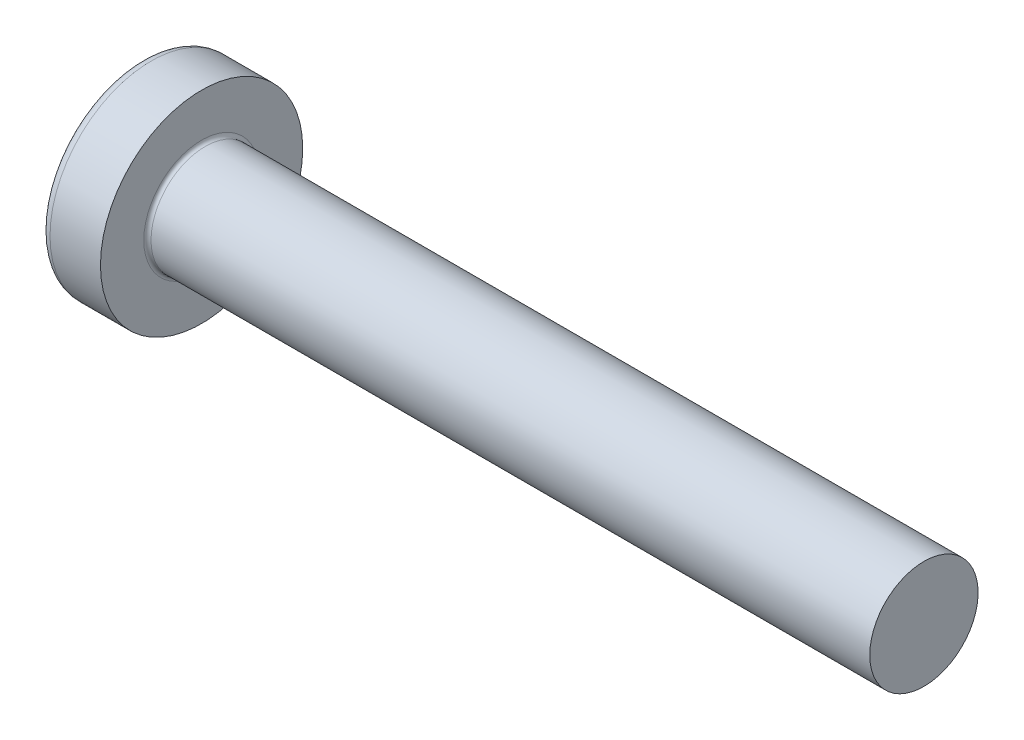
ISO-10303-21;
HEADER;
FILE_DESCRIPTION(('STEP AP214'),'2;1');
FILE_NAME('part.step','',(''),(''),'','','');
FILE_SCHEMA(('AUTOMOTIVE_DESIGN { 1 0 10303 214 1 1 1 1 }'));
ENDSEC;
DATA;
#1=APPLICATION_CONTEXT('core data for automotive mechanical design processes');
#2=APPLICATION_PROTOCOL_DEFINITION('international standard','automotive_design',2000,#1);
#3=PRODUCT_CONTEXT('',#1,'mechanical');
#4=PRODUCT('Part','Part','',(#3));
#5=PRODUCT_RELATED_PRODUCT_CATEGORY('part','',(#4));
#6=PRODUCT_DEFINITION_FORMATION('','',#4);
#7=PRODUCT_DEFINITION_CONTEXT('part definition',#1,'design');
#8=PRODUCT_DEFINITION('design','',#6,#7);
#9=PRODUCT_DEFINITION_SHAPE('','',#8);
#10=(LENGTH_UNIT() NAMED_UNIT(*) SI_UNIT(.MILLI.,.METRE.));
#11=(NAMED_UNIT(*) PLANE_ANGLE_UNIT() SI_UNIT($,.RADIAN.));
#12=(NAMED_UNIT(*) SI_UNIT($,.STERADIAN.) SOLID_ANGLE_UNIT());
#13=UNCERTAINTY_MEASURE_WITH_UNIT(LENGTH_MEASURE(1.E-05),#10,'distance_accuracy_value','');
#14=(GEOMETRIC_REPRESENTATION_CONTEXT(3) GLOBAL_UNCERTAINTY_ASSIGNED_CONTEXT((#13)) GLOBAL_UNIT_ASSIGNED_CONTEXT((#10,
#11,#12)) REPRESENTATION_CONTEXT('',''));
#15=CARTESIAN_POINT('',(0.,0.,0.));
#16=DIRECTION('',(0.,0.,1.));
#17=DIRECTION('',(1.,0.,0.));
#18=AXIS2_PLACEMENT_3D('',#15,#16,#17);
#19=CARTESIAN_POINT('',(5.,0.,0.));
#20=DIRECTION('',(-1.,0.,0.));
#21=DIRECTION('',(0.,1.,0.));
#22=AXIS2_PLACEMENT_3D('',#19,#20,#21);
#23=SPHERICAL_SURFACE('',#22,5.);
#24=CARTESIAN_POINT('',(0.775371598933733,0.,0.));
#25=DIRECTION('',(-1.,0.,0.));
#26=DIRECTION('',(0.,0.,1.));
#27=AXIS2_PLACEMENT_3D('',#24,#25,#26);
#28=CIRCLE('',#27,2.67441860465116);
#29=CARTESIAN_POINT('',(0.775371598933733,0.,2.67441860465116));
#30=VERTEX_POINT('',#29);
#31=EDGE_CURVE('E237',#30,#30,#28,.T.);
#32=ORIENTED_EDGE('',*,*,#31,.T.);
#33=EDGE_LOOP('',(#32));
#34=FACE_BOUND('',#33,.T.);
#35=CARTESIAN_POINT('',(0.0457951200896417,0.,0.));
#36=DIRECTION('',(1.,0.,0.));
#37=DIRECTION('',(0.,0.,-1.));
#38=AXIS2_PLACEMENT_3D('',#35,#36,#37);
#39=CIRCLE('',#38,0.675169614150692);
#40=CARTESIAN_POINT('',(0.0457951200896426,-0.369999999999998,-0.564760133040918));
#41=VERTEX_POINT('',#40);
#42=CARTESIAN_POINT('',(0.0457951200896417,-0.564760133040917,-0.37));
#43=VERTEX_POINT('',#42);
#44=EDGE_CURVE('E373',#41,#43,#39,.F.);
#45=ORIENTED_EDGE('',*,*,#44,.F.);
#46=CARTESIAN_POINT('',(5.,-0.37,0.));
#47=DIRECTION('',(0.,1.,0.));
#48=DIRECTION('',(0.,0.,1.));
#49=AXIS2_PLACEMENT_3D('',#46,#47,#48);
#50=CIRCLE('',#49,4.98629120689917);
#51=CARTESIAN_POINT('',(0.187869731256034,-0.369999999999995,-1.30633161051784));
#52=VERTEX_POINT('',#51);
#53=EDGE_CURVE('E299',#52,#41,#50,.T.);
#54=ORIENTED_EDGE('',*,*,#53,.F.);
#55=CARTESIAN_POINT('',(4.56358245832426,0.,0.875318202045668));
#56=DIRECTION('',(0.446197800778958,0.,-0.89493436774996));
#57=DIRECTION('',(-0.89493436774996,0.,-0.446197800778958));
#58=AXIS2_PLACEMENT_3D('',#55,#56,#57);
#59=CIRCLE('',#58,4.90340267309195);
#60=CARTESIAN_POINT('',(0.187869731256035,0.370000000000005,-1.30633161051784));
#61=VERTEX_POINT('',#60);
#62=EDGE_CURVE('E271',#52,#61,#59,.T.);
#63=ORIENTED_EDGE('',*,*,#62,.T.);
#64=CARTESIAN_POINT('',(5.,0.37,0.));
#65=DIRECTION('',(0.,-1.,0.));
#66=DIRECTION('',(0.,0.,-1.));
#67=AXIS2_PLACEMENT_3D('',#64,#65,#66);
#68=CIRCLE('',#67,4.98629120689917);
#69=CARTESIAN_POINT('',(0.0457951200896421,0.370000000000002,-0.564760133040916));
#70=VERTEX_POINT('',#69);
#71=EDGE_CURVE('E326',#70,#61,#68,.T.);
#72=ORIENTED_EDGE('',*,*,#71,.F.);
#73=CARTESIAN_POINT('',(0.0457951200896417,0.564760133040914,-0.37));
#74=VERTEX_POINT('',#73);
#75=EDGE_CURVE('E392',#74,#70,#39,.F.);
#76=ORIENTED_EDGE('',*,*,#75,.F.);
#77=CARTESIAN_POINT('',(5.,0.,-0.37));
#78=DIRECTION('',(0.,0.,1.));
#79=DIRECTION('',(1.,0.,0.));
#80=AXIS2_PLACEMENT_3D('',#77,#78,#79);
#81=CIRCLE('',#80,4.98629120689917);
#82=CARTESIAN_POINT('',(0.187869731256034,1.30633161051784,-0.37));
#83=VERTEX_POINT('',#82);
#84=EDGE_CURVE('E265',#83,#74,#81,.T.);
#85=ORIENTED_EDGE('',*,*,#84,.F.);
#86=CARTESIAN_POINT('',(4.56358245832426,-0.875318202045669,0.));
#87=DIRECTION('',(0.446197800778958,0.89493436774996,0.));
#88=DIRECTION('',(-0.89493436774996,0.446197800778958,0.));
#89=AXIS2_PLACEMENT_3D('',#86,#87,#88);
#90=CIRCLE('',#89,4.90340267309195);
#91=CARTESIAN_POINT('',(0.187869731256034,1.30633161051784,0.37));
#92=VERTEX_POINT('',#91);
#93=EDGE_CURVE('E268',#83,#92,#90,.T.);
#94=ORIENTED_EDGE('',*,*,#93,.T.);
#95=CARTESIAN_POINT('',(5.,0.,0.37));
#96=DIRECTION('',(0.,0.,-1.));
#97=DIRECTION('',(0.,1.,0.));
#98=AXIS2_PLACEMENT_3D('',#95,#96,#97);
#99=CIRCLE('',#98,4.98629120689917);
#100=CARTESIAN_POINT('',(0.0457951200896417,0.564760133040915,0.37));
#101=VERTEX_POINT('',#100);
#102=EDGE_CURVE('E261',#101,#92,#99,.T.);
#103=ORIENTED_EDGE('',*,*,#102,.F.);
#104=CARTESIAN_POINT('',(0.0457951200896425,0.369999999999998,0.564760133040918));
#105=VERTEX_POINT('',#104);
#106=EDGE_CURVE('E391',#105,#101,#39,.F.);
#107=ORIENTED_EDGE('',*,*,#106,.F.);
#108=CARTESIAN_POINT('',(0.187869731256033,0.369999999999995,1.30633161051784));
#109=VERTEX_POINT('',#108);
#110=EDGE_CURVE('E281',#109,#105,#68,.T.);
#111=ORIENTED_EDGE('',*,*,#110,.F.);
#112=CARTESIAN_POINT('',(4.56358245832426,0.,-0.875318202045668));
#113=DIRECTION('',(0.446197800778958,0.,0.89493436774996));
#114=DIRECTION('',(0.89493436774996,0.,-0.446197800778958));
#115=AXIS2_PLACEMENT_3D('',#112,#113,#114);
#116=CIRCLE('',#115,4.90340267309195);
#117=CARTESIAN_POINT('',(0.187869731256033,-0.370000000000005,1.30633161051784));
#118=VERTEX_POINT('',#117);
#119=EDGE_CURVE('E48',#109,#118,#116,.T.);
#120=ORIENTED_EDGE('',*,*,#119,.T.);
#121=CARTESIAN_POINT('',(0.0457951200896421,-0.370000000000002,0.564760133040916));
#122=VERTEX_POINT('',#121);
#123=EDGE_CURVE('E278',#122,#118,#50,.T.);
#124=ORIENTED_EDGE('',*,*,#123,.F.);
#125=CARTESIAN_POINT('',(0.0457951200896417,-0.564760133040917,0.37));
#126=VERTEX_POINT('',#125);
#127=EDGE_CURVE('E427',#126,#122,#39,.F.);
#128=ORIENTED_EDGE('',*,*,#127,.F.);
#129=CARTESIAN_POINT('',(0.187869731256033,-1.30633161051784,0.37));
#130=VERTEX_POINT('',#129);
#131=EDGE_CURVE('E262',#130,#126,#99,.T.);
#132=ORIENTED_EDGE('',*,*,#131,.F.);
#133=CARTESIAN_POINT('',(4.56358245832426,0.875318202045668,0.));
#134=DIRECTION('',(0.446197800778958,-0.89493436774996,0.));
#135=DIRECTION('',(0.89493436774996,0.446197800778958,0.));
#136=AXIS2_PLACEMENT_3D('',#133,#134,#135);
#137=CIRCLE('',#136,4.90340267309195);
#138=CARTESIAN_POINT('',(0.187869731256033,-1.30633161051784,-0.37));
#139=VERTEX_POINT('',#138);
#140=EDGE_CURVE('E258',#130,#139,#137,.T.);
#141=ORIENTED_EDGE('',*,*,#140,.T.);
#142=EDGE_CURVE('E63',#43,#139,#81,.T.);
#143=ORIENTED_EDGE('',*,*,#142,.F.);
#144=EDGE_LOOP('',(#45,#54,#63,#72,#76,#85,#94,#103,#107,#111,#120,#124,#128,#132,#141,#143));
#145=FACE_BOUND('',#144,.T.);
#146=ADVANCED_FACE('F35',(#34,#145),#23,.T.);
#147=CARTESIAN_POINT('',(1.75,0.527482216012805,-0.37));
#148=DIRECTION('',(0.,0.,1.));
#149=DIRECTION('',(1.,0.,0.));
#150=AXIS2_PLACEMENT_3D('',#147,#148,#149);
#151=PLANE('',#150);
#152=ORIENTED_EDGE('',*,*,#84,.T.);
#153=CARTESIAN_POINT('',(-0.987293237053715,0.64940125596716,-0.37));
#154=CARTESIAN_POINT('',(-0.781914975317084,0.632865887002871,-0.37));
#155=CARTESIAN_POINT('',(-0.576547882393372,0.616188977635081,-0.37));
#156=CARTESIAN_POINT('',(-0.165841599226327,0.582441031964227,-0.37));
#157=CARTESIAN_POINT('',(0.0394975903090454,0.565369987054879,-0.37));
#158=CARTESIAN_POINT('',(0.450133475422572,0.530723441326535,-0.37));
#159=CARTESIAN_POINT('',(0.655430171010573,0.513147940624557,-0.37));
#160=CARTESIAN_POINT('',(1.06596140177934,0.477314957985794,-0.37));
#161=CARTESIAN_POINT('',(1.2711959378071,0.459057485806066,-0.37));
#162=CARTESIAN_POINT('',(1.61065292365626,0.428051938688768,-0.37));
#163=CARTESIAN_POINT('',(1.74490059995643,0.415580824990931,-0.37));
#164=CARTESIAN_POINT('',(2.01334321762763,0.390092023404979,-0.37));
#165=CARTESIAN_POINT('',(2.14753815934577,0.377074339177353,-0.37));
#166=CARTESIAN_POINT('',(2.41586354151957,0.350315629452843,-0.37));
#167=CARTESIAN_POINT('',(2.5499939784531,0.33657456817765,-0.37));
#168=CARTESIAN_POINT('',(2.81814173295471,0.308004077741875,-0.37));
#169=CARTESIAN_POINT('',(2.95215904765134,0.293174621747065,-0.37));
#170=CARTESIAN_POINT('',(3.0860955068368,0.277618485071816,-0.37));
#171=B_SPLINE_CURVE_WITH_KNOTS('',3,(#153,#154,#155,#156,#157,#158,#159,#160,#161,#162,#163,
#164,#165,#166,#167,#168,#169,#170),.UNSPECIFIED.,.F.,.F.,(4,2,2,2,2,2,2,2,4),(0.,
0.618128793984691,1.23627109812525,1.85441325887562,2.4725465791681,2.87702276218609,
3.28149623678161,3.68598973550942,4.09049321032311),.UNSPECIFIED.);
#172=CARTESIAN_POINT('',(1.75,0.415013252800437,-0.37));
#173=VERTEX_POINT('',#172);
#174=EDGE_CURVE('E413',#74,#173,#171,.T.);
#175=ORIENTED_EDGE('',*,*,#174,.T.);
#176=DIRECTION('',(0.,1.,0.));
#177=VECTOR('',#176,1.);
#178=CARTESIAN_POINT('',(1.75,-0.527482216012805,-0.37));
#179=LINE('',#178,#177);
#180=CARTESIAN_POINT('',(1.75,0.527482216012805,-0.37));
#181=VERTEX_POINT('',#180);
#182=EDGE_CURVE('E355',#173,#181,#179,.T.);
#183=ORIENTED_EDGE('',*,*,#182,.T.);
#184=DIRECTION('',(0.89493436774996,-0.446197800778958,0.));
#185=VECTOR('',#184,1.);
#186=CARTESIAN_POINT('',(0.,1.4,-0.37));
#187=LINE('',#186,#185);
#188=EDGE_CURVE('E238',#83,#181,#187,.T.);
#189=ORIENTED_EDGE('',*,*,#188,.F.);
#190=EDGE_LOOP('',(#152,#175,#183,#189));
#191=FACE_BOUND('',#190,.T.);
#192=ADVANCED_FACE('F193',(#191),#151,.T.);
#193=CARTESIAN_POINT('',(1.75,-0.527482216012805,-0.37));
#194=VERTEX_POINT('',#193);
#195=CARTESIAN_POINT('',(1.75,-0.415013252800437,-0.37));
#196=VERTEX_POINT('',#195);
#197=EDGE_CURVE('E246',#194,#196,#179,.T.);
#198=ORIENTED_EDGE('',*,*,#197,.T.);
#199=CARTESIAN_POINT('',(-0.987293237053715,-0.64940125596716,-0.37));
#200=CARTESIAN_POINT('',(-0.781914975317084,-0.632865887002871,-0.37));
#201=CARTESIAN_POINT('',(-0.576547882393372,-0.616188977635081,-0.37));
#202=CARTESIAN_POINT('',(-0.165841599226327,-0.582441031964227,-0.37));
#203=CARTESIAN_POINT('',(0.0394975903090452,-0.565369987054879,-0.37));
#204=CARTESIAN_POINT('',(0.450133475422572,-0.530723441326535,-0.37));
#205=CARTESIAN_POINT('',(0.655430171010574,-0.513147940624557,-0.37));
#206=CARTESIAN_POINT('',(1.06596140177934,-0.477314957985794,-0.37));
#207=CARTESIAN_POINT('',(1.2711959378071,-0.459057485806066,-0.37));
#208=CARTESIAN_POINT('',(1.61065292365626,-0.428051938688768,-0.37));
#209=CARTESIAN_POINT('',(1.74490059995643,-0.415580824990931,-0.37));
#210=CARTESIAN_POINT('',(2.01334321762763,-0.39009202340498,-0.37));
#211=CARTESIAN_POINT('',(2.14753815934577,-0.377074339177353,-0.37));
#212=CARTESIAN_POINT('',(2.41586354151957,-0.350315629452843,-0.37));
#213=CARTESIAN_POINT('',(2.5499939784531,-0.33657456817765,-0.37));
#214=CARTESIAN_POINT('',(2.81814173295471,-0.308004077741875,-0.37));
#215=CARTESIAN_POINT('',(2.95215904765134,-0.293174621747065,-0.37));
#216=CARTESIAN_POINT('',(3.0860955068368,-0.277618485071816,-0.37));
#217=B_SPLINE_CURVE_WITH_KNOTS('',3,(#199,#200,#201,#202,#203,#204,#205,#206,#207,#208,#209,
#210,#211,#212,#213,#214,#215,#216),.UNSPECIFIED.,.F.,.F.,(4,2,2,2,2,2,2,2,4),(0.,
0.61812879398469,1.23627109812525,1.85441325887562,2.4725465791681,2.87702276218609,
3.28149623678161,3.68598973550942,4.09049321032311),.UNSPECIFIED.);
#218=EDGE_CURVE('E390',#196,#43,#217,.F.);
#219=ORIENTED_EDGE('',*,*,#218,.T.);
#220=ORIENTED_EDGE('',*,*,#142,.T.);
#221=DIRECTION('',(0.89493436774996,0.446197800778958,0.));
#222=VECTOR('',#221,1.);
#223=CARTESIAN_POINT('',(0.,-1.4,-0.37));
#224=LINE('',#223,#222);
#225=EDGE_CURVE('E329',#139,#194,#224,.T.);
#226=ORIENTED_EDGE('',*,*,#225,.T.);
#227=EDGE_LOOP('',(#198,#219,#220,#226));
#228=FACE_BOUND('',#227,.T.);
#229=ADVANCED_FACE('F199',(#228),#151,.T.);
#230=CARTESIAN_POINT('',(1.75,-0.527482216012805,0.37));
#231=DIRECTION('',(0.,0.,-1.));
#232=DIRECTION('',(0.,1.,0.));
#233=AXIS2_PLACEMENT_3D('',#230,#231,#232);
#234=PLANE('',#233);
#235=DIRECTION('',(0.,-1.,0.));
#236=VECTOR('',#235,1.);
#237=CARTESIAN_POINT('',(1.75,0.527482216012805,0.37));
#238=LINE('',#237,#236);
#239=CARTESIAN_POINT('',(1.75,0.527482216012805,0.37));
#240=VERTEX_POINT('',#239);
#241=CARTESIAN_POINT('',(1.75,0.415013252800437,0.37));
#242=VERTEX_POINT('',#241);
#243=EDGE_CURVE('E338',#240,#242,#238,.T.);
#244=ORIENTED_EDGE('',*,*,#243,.T.);
#245=CARTESIAN_POINT('',(-0.987293237053715,0.64940125596716,0.37));
#246=CARTESIAN_POINT('',(-0.781914975317084,0.632865887002871,0.37));
#247=CARTESIAN_POINT('',(-0.576547882393372,0.616188977635081,0.37));
#248=CARTESIAN_POINT('',(-0.165841599226327,0.582441031964227,0.37));
#249=CARTESIAN_POINT('',(0.0394975903090455,0.56536998705488,0.37));
#250=CARTESIAN_POINT('',(0.450133475422572,0.530723441326535,0.37));
#251=CARTESIAN_POINT('',(0.655430171010573,0.513147940624557,0.37));
#252=CARTESIAN_POINT('',(1.06596140177934,0.477314957985794,0.37));
#253=CARTESIAN_POINT('',(1.2711959378071,0.459057485806066,0.37));
#254=CARTESIAN_POINT('',(1.61065292365626,0.428051938688768,0.37));
#255=CARTESIAN_POINT('',(1.74490059995642,0.415580824990931,0.37));
#256=CARTESIAN_POINT('',(2.01334321762763,0.39009202340498,0.37));
#257=CARTESIAN_POINT('',(2.14753815934577,0.377074339177353,0.37));
#258=CARTESIAN_POINT('',(2.41586354151957,0.350315629452843,0.37));
#259=CARTESIAN_POINT('',(2.5499939784531,0.33657456817765,0.37));
#260=CARTESIAN_POINT('',(2.81814173295471,0.308004077741875,0.37));
#261=CARTESIAN_POINT('',(2.95215904765134,0.293174621747065,0.37));
#262=CARTESIAN_POINT('',(3.0860955068368,0.277618485071816,0.37));
#263=B_SPLINE_CURVE_WITH_KNOTS('',3,(#245,#246,#247,#248,#249,#250,#251,#252,#253,#254,#255,
#256,#257,#258,#259,#260,#261,#262),.UNSPECIFIED.,.F.,.F.,(4,2,2,2,2,2,2,2,4),(0.,
0.618128793984691,1.23627109812525,1.85441325887562,2.4725465791681,2.87702276218609,
3.28149623678161,3.68598973550942,4.09049321032311),.UNSPECIFIED.);
#264=EDGE_CURVE('E665',#242,#101,#263,.F.);
#265=ORIENTED_EDGE('',*,*,#264,.T.);
#266=ORIENTED_EDGE('',*,*,#102,.T.);
#267=DIRECTION('',(0.89493436774996,-0.446197800778958,0.));
#268=VECTOR('',#267,1.);
#269=CARTESIAN_POINT('',(0.,1.4,0.37));
#270=LINE('',#269,#268);
#271=EDGE_CURVE('E243',#92,#240,#270,.T.);
#272=ORIENTED_EDGE('',*,*,#271,.T.);
#273=EDGE_LOOP('',(#244,#265,#266,#272));
#274=FACE_BOUND('',#273,.T.);
#275=ADVANCED_FACE('F409',(#274),#234,.T.);
#276=ORIENTED_EDGE('',*,*,#131,.T.);
#277=CARTESIAN_POINT('',(-0.987293237069634,-0.649401255968442,0.37));
#278=CARTESIAN_POINT('',(-0.781914975331301,-0.632865887004023,0.37));
#279=CARTESIAN_POINT('',(-0.576547882405888,-0.616188977636102,0.37));
#280=CARTESIAN_POINT('',(-0.165841599235439,-0.582441031964982,0.37));
#281=CARTESIAN_POINT('',(0.0394975903016338,-0.5653699870555,0.37));
#282=CARTESIAN_POINT('',(0.450133475420601,-0.530723441326706,0.37));
#283=CARTESIAN_POINT('',(0.655430171012341,-0.513147940624409,0.37));
#284=CARTESIAN_POINT('',(1.06596140178858,-0.477314957984981,0.37));
#285=CARTESIAN_POINT('',(1.27119593782008,-0.459057485804908,0.37));
#286=CARTESIAN_POINT('',(1.61065292367297,-0.428051938687225,0.37));
#287=CARTESIAN_POINT('',(1.74490059997313,-0.415580824989368,0.37));
#288=CARTESIAN_POINT('',(2.01334321764434,-0.390092023403371,0.37));
#289=CARTESIAN_POINT('',(2.14753815936247,-0.377074339175718,0.37));
#290=CARTESIAN_POINT('',(2.41586354153627,-0.350315629451146,0.37));
#291=CARTESIAN_POINT('',(2.54999397846979,-0.336574568175918,0.37));
#292=CARTESIAN_POINT('',(2.8181417329714,-0.308004077740054,0.37));
#293=CARTESIAN_POINT('',(2.95215904766802,-0.29317462174519,0.37));
#294=CARTESIAN_POINT('',(3.08609550685347,-0.277618485069873,0.37));
#295=B_SPLINE_CURVE_WITH_KNOTS('',3,(#277,#278,#279,#280,#281,#282,#283,#284,#285,#286,#287,
#288,#289,#290,#291,#292,#293,#294),.UNSPECIFIED.,.F.,.F.,(4,2,2,2,2,2,2,2,4),(0.,
0.61812879398981,1.23627109813549,1.85441325889711,2.47254657920086,2.87702276221884,
3.28149623681436,3.68598973554217,4.09049321035586),.UNSPECIFIED.);
#296=CARTESIAN_POINT('',(1.75,-0.415013252800437,0.37));
#297=VERTEX_POINT('',#296);
#298=EDGE_CURVE('E428',#126,#297,#295,.T.);
#299=ORIENTED_EDGE('',*,*,#298,.T.);
#300=CARTESIAN_POINT('',(1.75,-0.527482216012805,0.37));
#301=VERTEX_POINT('',#300);
#302=EDGE_CURVE('E340',#297,#301,#238,.T.);
#303=ORIENTED_EDGE('',*,*,#302,.T.);
#304=DIRECTION('',(0.89493436774996,0.446197800778958,0.));
#305=VECTOR('',#304,1.);
#306=CARTESIAN_POINT('',(0.,-1.4,0.37));
#307=LINE('',#306,#305);
#308=EDGE_CURVE('E331',#130,#301,#307,.T.);
#309=ORIENTED_EDGE('',*,*,#308,.F.);
#310=EDGE_LOOP('',(#276,#299,#303,#309));
#311=FACE_BOUND('',#310,.T.);
#312=ADVANCED_FACE('F519',(#311),#234,.T.);
#313=CARTESIAN_POINT('',(1.75,0.527482216012805,0.37));
#314=DIRECTION('',(0.446197800778958,0.89493436774996,0.));
#315=DIRECTION('',(-0.89493436774996,0.446197800778958,0.));
#316=AXIS2_PLACEMENT_3D('',#313,#314,#315);
#317=PLANE('',#316);
#318=CARTESIAN_POINT('',(2.66965234556629,0.0689604865315903,0.));
#319=DIRECTION('',(0.446197800778958,0.89493436774996,0.));
#320=DIRECTION('',(-0.89493436774996,0.446197800778958,0.));
#321=AXIS2_PLACEMENT_3D('',#318,#319,#320);
#322=ELLIPSE('',#321,1.10195891266117,0.486831719863513);
#323=CARTESIAN_POINT('',(1.75,0.527482216012806,0.175779725196678));
#324=VERTEX_POINT('',#323);
#325=CARTESIAN_POINT('',(1.75,0.527482216012806,-0.175779725196678));
#326=VERTEX_POINT('',#325);
#327=EDGE_CURVE('E304',#324,#326,#322,.F.);
#328=ORIENTED_EDGE('',*,*,#327,.F.);
#329=DIRECTION('',(0.,0.,-1.));
#330=VECTOR('',#329,1.);
#331=CARTESIAN_POINT('',(1.75,0.527482216012805,0.37));
#332=LINE('',#331,#330);
#333=EDGE_CURVE('E341',#240,#324,#332,.T.);
#334=ORIENTED_EDGE('',*,*,#333,.F.);
#335=ORIENTED_EDGE('',*,*,#271,.F.);
#336=ORIENTED_EDGE('',*,*,#93,.F.);
#337=ORIENTED_EDGE('',*,*,#188,.T.);
#338=EDGE_CURVE('E343',#326,#181,#332,.T.);
#339=ORIENTED_EDGE('',*,*,#338,.F.);
#340=EDGE_LOOP('',(#328,#334,#335,#336,#337,#339));
#341=FACE_BOUND('',#340,.T.);
#342=ADVANCED_FACE('F407',(#341),#317,.F.);
#343=CARTESIAN_POINT('',(0.,-1.4,-0.37));
#344=DIRECTION('',(0.446197800778958,-0.89493436774996,0.));
#345=DIRECTION('',(0.89493436774996,0.446197800778958,0.));
#346=AXIS2_PLACEMENT_3D('',#343,#344,#345);
#347=PLANE('',#346);
#348=CARTESIAN_POINT('',(2.66965234556629,-0.0689604865315903,0.));
#349=DIRECTION('',(0.446197800778958,-0.89493436774996,0.));
#350=DIRECTION('',(-0.89493436774996,-0.446197800778958,0.));
#351=AXIS2_PLACEMENT_3D('',#348,#349,#350);
#352=ELLIPSE('',#351,1.10195891266117,0.486831719863513);
#353=CARTESIAN_POINT('',(1.75,-0.527482216012806,-0.175779725196678));
#354=VERTEX_POINT('',#353);
#355=CARTESIAN_POINT('',(1.75,-0.527482216012806,0.175779725196678));
#356=VERTEX_POINT('',#355);
#357=EDGE_CURVE('E667',#354,#356,#352,.F.);
#358=ORIENTED_EDGE('',*,*,#357,.F.);
#359=DIRECTION('',(0.,0.,1.));
#360=VECTOR('',#359,1.);
#361=CARTESIAN_POINT('',(1.75,-0.527482216012805,-0.37));
#362=LINE('',#361,#360);
#363=EDGE_CURVE('E334',#194,#354,#362,.T.);
#364=ORIENTED_EDGE('',*,*,#363,.F.);
#365=ORIENTED_EDGE('',*,*,#225,.F.);
#366=ORIENTED_EDGE('',*,*,#140,.F.);
#367=ORIENTED_EDGE('',*,*,#308,.T.);
#368=EDGE_CURVE('E337',#356,#301,#362,.T.);
#369=ORIENTED_EDGE('',*,*,#368,.F.);
#370=EDGE_LOOP('',(#358,#364,#365,#366,#367,#369));
#371=FACE_BOUND('',#370,.T.);
#372=ADVANCED_FACE('F506',(#371),#347,.F.);
#373=CARTESIAN_POINT('',(1.75,0.527482216012805,-0.37));
#374=DIRECTION('',(-1.,0.,0.));
#375=DIRECTION('',(0.,0.,1.));
#376=AXIS2_PLACEMENT_3D('',#373,#374,#375);
#377=PLANE('',#376);
#378=DIRECTION('',(0.,1.,0.));
#379=VECTOR('',#378,1.);
#380=CARTESIAN_POINT('',(1.75,-0.370000000000002,0.527482216012804));
#381=LINE('',#380,#379);
#382=CARTESIAN_POINT('',(1.75,-0.370000000000002,0.527482216012804));
#383=VERTEX_POINT('',#382);
#384=CARTESIAN_POINT('',(1.75,-0.175779725196681,0.527482216012805));
#385=VERTEX_POINT('',#384);
#386=EDGE_CURVE('E319',#383,#385,#381,.T.);
#387=ORIENTED_EDGE('',*,*,#386,.T.);
#388=CARTESIAN_POINT('',(1.75,0.,0.));
#389=DIRECTION('',(-1.,0.,0.));
#390=DIRECTION('',(0.,0.,1.));
#391=AXIS2_PLACEMENT_3D('',#388,#389,#390);
#392=CIRCLE('',#391,0.556);
#393=CARTESIAN_POINT('',(1.75,-0.370000000000001,0.415013252800436));
#394=VERTEX_POINT('',#393);
#395=EDGE_CURVE('E693',#394,#385,#392,.T.);
#396=ORIENTED_EDGE('',*,*,#395,.F.);
#397=DIRECTION('',(0.,0.,-1.));
#398=VECTOR('',#397,1.);
#399=CARTESIAN_POINT('',(1.75,-0.370000000000002,0.527482216012804));
#400=LINE('',#399,#398);
#401=EDGE_CURVE('E315',#383,#394,#400,.T.);
#402=ORIENTED_EDGE('',*,*,#401,.F.);
#403=EDGE_LOOP('',(#387,#396,#402));
#404=FACE_BOUND('',#403,.T.);
#405=ADVANCED_FACE('F463',(#404),#377,.T.);
#406=ORIENTED_EDGE('',*,*,#302,.F.);
#407=EDGE_CURVE('E698',#356,#297,#392,.T.);
#408=ORIENTED_EDGE('',*,*,#407,.F.);
#409=ORIENTED_EDGE('',*,*,#368,.T.);
#410=EDGE_LOOP('',(#406,#408,#409));
#411=FACE_BOUND('',#410,.T.);
#412=ADVANCED_FACE('F493',(#411),#377,.T.);
#413=ORIENTED_EDGE('',*,*,#363,.T.);
#414=EDGE_CURVE('E384',#196,#354,#392,.T.);
#415=ORIENTED_EDGE('',*,*,#414,.F.);
#416=ORIENTED_EDGE('',*,*,#197,.F.);
#417=EDGE_LOOP('',(#413,#415,#416));
#418=FACE_BOUND('',#417,.T.);
#419=ADVANCED_FACE('F487',(#418),#377,.T.);
#420=CARTESIAN_POINT('',(1.75,-0.369999999999998,-0.415013252800438));
#421=VERTEX_POINT('',#420);
#422=CARTESIAN_POINT('',(1.75,-0.369999999999998,-0.527482216012807));
#423=VERTEX_POINT('',#422);
#424=EDGE_CURVE('E318',#421,#423,#400,.T.);
#425=ORIENTED_EDGE('',*,*,#424,.F.);
#426=CARTESIAN_POINT('',(1.75,-0.175779725196678,-0.527482216012806));
#427=VERTEX_POINT('',#426);
#428=EDGE_CURVE('E55',#427,#421,#392,.T.);
#429=ORIENTED_EDGE('',*,*,#428,.F.);
#430=DIRECTION('',(0.,-1.,0.));
#431=VECTOR('',#430,1.);
#432=CARTESIAN_POINT('',(1.75,0.370000000000002,-0.527482216012804));
#433=LINE('',#432,#431);
#434=EDGE_CURVE('E314',#427,#423,#433,.T.);
#435=ORIENTED_EDGE('',*,*,#434,.T.);
#436=EDGE_LOOP('',(#425,#429,#435));
#437=FACE_BOUND('',#436,.T.);
#438=ADVANCED_FACE('F379',(#437),#377,.T.);
#439=CARTESIAN_POINT('',(1.75,0.370000000000002,-0.527482216012804));
#440=VERTEX_POINT('',#439);
#441=CARTESIAN_POINT('',(1.75,0.175779725196681,-0.527482216012805));
#442=VERTEX_POINT('',#441);
#443=EDGE_CURVE('E311',#440,#442,#433,.T.);
#444=ORIENTED_EDGE('',*,*,#443,.T.);
#445=CARTESIAN_POINT('',(1.75,0.370000000000001,-0.415013252800436));
#446=VERTEX_POINT('',#445);
#447=EDGE_CURVE('E383',#446,#442,#392,.T.);
#448=ORIENTED_EDGE('',*,*,#447,.F.);
#449=DIRECTION('',(0.,0.,1.));
#450=VECTOR('',#449,1.);
#451=CARTESIAN_POINT('',(1.75,0.370000000000002,-0.527482216012804));
#452=LINE('',#451,#450);
#453=EDGE_CURVE('E323',#440,#446,#452,.T.);
#454=ORIENTED_EDGE('',*,*,#453,.F.);
#455=EDGE_LOOP('',(#444,#448,#454));
#456=FACE_BOUND('',#455,.T.);
#457=ADVANCED_FACE('F475',(#456),#377,.T.);
#458=ORIENTED_EDGE('',*,*,#182,.F.);
#459=EDGE_CURVE('E682',#326,#173,#392,.T.);
#460=ORIENTED_EDGE('',*,*,#459,.F.);
#461=ORIENTED_EDGE('',*,*,#338,.T.);
#462=EDGE_LOOP('',(#458,#460,#461));
#463=FACE_BOUND('',#462,.T.);
#464=ADVANCED_FACE('F469',(#463),#377,.T.);
#465=ORIENTED_EDGE('',*,*,#333,.T.);
#466=EDGE_CURVE('E684',#242,#324,#392,.T.);
#467=ORIENTED_EDGE('',*,*,#466,.F.);
#468=ORIENTED_EDGE('',*,*,#243,.F.);
#469=EDGE_LOOP('',(#465,#467,#468));
#470=FACE_BOUND('',#469,.T.);
#471=ADVANCED_FACE('F461',(#470),#377,.T.);
#472=CARTESIAN_POINT('',(1.75,0.369999999999999,0.415013252800439));
#473=VERTEX_POINT('',#472);
#474=CARTESIAN_POINT('',(1.75,0.369999999999998,0.527482216012807));
#475=VERTEX_POINT('',#474);
#476=EDGE_CURVE('E296',#473,#475,#452,.T.);
#477=ORIENTED_EDGE('',*,*,#476,.F.);
#478=CARTESIAN_POINT('',(1.75,0.175779725196678,0.527482216012806));
#479=VERTEX_POINT('',#478);
#480=EDGE_CURVE('E385',#479,#473,#392,.T.);
#481=ORIENTED_EDGE('',*,*,#480,.F.);
#482=EDGE_CURVE('E322',#479,#475,#381,.T.);
#483=ORIENTED_EDGE('',*,*,#482,.T.);
#484=EDGE_LOOP('',(#477,#481,#483));
#485=FACE_BOUND('',#484,.T.);
#486=ADVANCED_FACE('F455',(#485),#377,.T.);
#487=CARTESIAN_POINT('',(1.75,0.369999999999998,0.527482216012806));
#488=DIRECTION('',(0.,-1.,0.));
#489=DIRECTION('',(1.,0.,0.));
#490=AXIS2_PLACEMENT_3D('',#487,#488,#489);
#491=PLANE('',#490);
#492=ORIENTED_EDGE('',*,*,#110,.T.);
#493=CARTESIAN_POINT('',(-0.987293237069634,0.369999999999998,0.649401255968443));
#494=CARTESIAN_POINT('',(-0.781914975331301,0.369999999999998,0.632865887004024));
#495=CARTESIAN_POINT('',(-0.576547882405888,0.369999999999998,0.616188977636103));
#496=CARTESIAN_POINT('',(-0.16584159923544,0.369999999999998,0.582441031964984));
#497=CARTESIAN_POINT('',(0.0394975903016338,0.369999999999998,0.565369987055501));
#498=CARTESIAN_POINT('',(0.450133475420601,0.369999999999998,0.530723441326707));
#499=CARTESIAN_POINT('',(0.655430171012341,0.369999999999998,0.51314794062441));
#500=CARTESIAN_POINT('',(1.06596140178858,0.369999999999998,0.477314957984982));
#501=CARTESIAN_POINT('',(1.27119593782008,0.369999999999998,0.459057485804909));
#502=CARTESIAN_POINT('',(1.61065292367297,0.369999999999999,0.428051938687226));
#503=CARTESIAN_POINT('',(1.74490059997313,0.369999999999999,0.415580824989369));
#504=CARTESIAN_POINT('',(2.01334321764434,0.369999999999999,0.390092023403372));
#505=CARTESIAN_POINT('',(2.14753815936247,0.369999999999999,0.37707433917572));
#506=CARTESIAN_POINT('',(2.41586354153627,0.369999999999999,0.350315629451147));
#507=CARTESIAN_POINT('',(2.54999397846979,0.369999999999999,0.336574568175919));
#508=CARTESIAN_POINT('',(2.8181417329714,0.369999999999999,0.308004077740055));
#509=CARTESIAN_POINT('',(2.95215904766802,0.369999999999999,0.293174621745191));
#510=CARTESIAN_POINT('',(3.08609550685347,0.369999999999999,0.277618485069875));
#511=B_SPLINE_CURVE_WITH_KNOTS('',3,(#493,#494,#495,#496,#497,#498,#499,#500,#501,#502,#503,
#504,#505,#506,#507,#508,#509,#510),.UNSPECIFIED.,.F.,.F.,(4,2,2,2,2,2,2,2,4),(0.,
0.61812879398981,1.23627109813549,1.85441325889711,2.47254657920086,2.87702276221884,
3.28149623681436,3.68598973554218,4.09049321035586),.UNSPECIFIED.);
#512=EDGE_CURVE('E664',#105,#473,#511,.T.);
#513=ORIENTED_EDGE('',*,*,#512,.T.);
#514=ORIENTED_EDGE('',*,*,#476,.T.);
#515=DIRECTION('',(0.89493436774996,0.,-0.446197800778958));
#516=VECTOR('',#515,1.);
#517=CARTESIAN_POINT('',(0.,0.369999999999995,1.4));
#518=LINE('',#517,#516);
#519=EDGE_CURVE('E289',#109,#475,#518,.T.);
#520=ORIENTED_EDGE('',*,*,#519,.F.);
#521=EDGE_LOOP('',(#492,#513,#514,#520));
#522=FACE_BOUND('',#521,.T.);
#523=ADVANCED_FACE('F293',(#522),#491,.T.);
#524=CARTESIAN_POINT('',(1.75,-0.369999999999998,-0.527482216012807));
#525=DIRECTION('',(0.,1.,0.));
#526=DIRECTION('',(0.,0.,1.));
#527=AXIS2_PLACEMENT_3D('',#524,#525,#526);
#528=PLANE('',#527);
#529=ORIENTED_EDGE('',*,*,#401,.T.);
#530=CARTESIAN_POINT('',(-0.987293237053715,-0.370000000000002,0.649401255967159));
#531=CARTESIAN_POINT('',(-0.781914975317084,-0.370000000000002,0.63286588700287));
#532=CARTESIAN_POINT('',(-0.576547882393372,-0.370000000000002,0.616188977635079));
#533=CARTESIAN_POINT('',(-0.165841599226327,-0.370000000000002,0.582441031964225));
#534=CARTESIAN_POINT('',(0.0394975903090452,-0.370000000000002,0.565369987054878));
#535=CARTESIAN_POINT('',(0.450133475422572,-0.370000000000002,0.530723441326534));
#536=CARTESIAN_POINT('',(0.655430171010573,-0.370000000000002,0.513147940624556));
#537=CARTESIAN_POINT('',(1.06596140177934,-0.370000000000002,0.477314957985792));
#538=CARTESIAN_POINT('',(1.2711959378071,-0.370000000000002,0.459057485806065));
#539=CARTESIAN_POINT('',(1.61065292365626,-0.370000000000001,0.428051938688767));
#540=CARTESIAN_POINT('',(1.74490059995642,-0.370000000000001,0.41558082499093));
#541=CARTESIAN_POINT('',(2.01334321762763,-0.370000000000001,0.390092023404978));
#542=CARTESIAN_POINT('',(2.14753815934577,-0.370000000000001,0.377074339177352));
#543=CARTESIAN_POINT('',(2.41586354151957,-0.370000000000001,0.350315629452841));
#544=CARTESIAN_POINT('',(2.5499939784531,-0.370000000000001,0.336574568177649));
#545=CARTESIAN_POINT('',(2.81814173295471,-0.370000000000001,0.308004077741874));
#546=CARTESIAN_POINT('',(2.95215904765134,-0.370000000000001,0.293174621747064));
#547=CARTESIAN_POINT('',(3.0860955068368,-0.370000000000001,0.277618485071815));
#548=B_SPLINE_CURVE_WITH_KNOTS('',3,(#530,#531,#532,#533,#534,#535,#536,#537,#538,#539,#540,
#541,#542,#543,#544,#545,#546,#547),.UNSPECIFIED.,.F.,.F.,(4,2,2,2,2,2,2,2,4),(0.,
0.618128793984691,1.23627109812525,1.85441325887562,2.4725465791681,2.87702276218609,
3.28149623678161,3.68598973550942,4.09049321032311),.UNSPECIFIED.);
#549=EDGE_CURVE('E421',#394,#122,#548,.F.);
#550=ORIENTED_EDGE('',*,*,#549,.T.);
#551=ORIENTED_EDGE('',*,*,#123,.T.);
#552=DIRECTION('',(0.89493436774996,0.,-0.446197800778958));
#553=VECTOR('',#552,1.);
#554=CARTESIAN_POINT('',(0.,-0.370000000000005,1.4));
#555=LINE('',#554,#553);
#556=EDGE_CURVE('E291',#118,#383,#555,.T.);
#557=ORIENTED_EDGE('',*,*,#556,.T.);
#558=EDGE_LOOP('',(#529,#550,#551,#557));
#559=FACE_BOUND('',#558,.T.);
#560=ADVANCED_FACE('F228',(#559),#528,.T.);
#561=CARTESIAN_POINT('',(1.75,-0.370000000000002,0.527482216012804));
#562=DIRECTION('',(0.446197800778958,0.,0.89493436774996));
#563=DIRECTION('',(-0.89493436774996,0.,0.446197800778958));
#564=AXIS2_PLACEMENT_3D('',#561,#562,#563);
#565=PLANE('',#564);
#566=CARTESIAN_POINT('',(2.66965234556629,0.,0.0689604865315903));
#567=DIRECTION('',(0.446197800778958,0.,0.89493436774996));
#568=DIRECTION('',(-0.89493436774996,0.,0.446197800778958));
#569=AXIS2_PLACEMENT_3D('',#566,#567,#568);
#570=ELLIPSE('',#569,1.10195891266117,0.486831719863513);
#571=EDGE_CURVE('E419',#385,#479,#570,.F.);
#572=ORIENTED_EDGE('',*,*,#571,.F.);
#573=ORIENTED_EDGE('',*,*,#386,.F.);
#574=ORIENTED_EDGE('',*,*,#556,.F.);
#575=ORIENTED_EDGE('',*,*,#119,.F.);
#576=ORIENTED_EDGE('',*,*,#519,.T.);
#577=ORIENTED_EDGE('',*,*,#482,.F.);
#578=EDGE_LOOP('',(#572,#573,#574,#575,#576,#577));
#579=FACE_BOUND('',#578,.T.);
#580=ADVANCED_FACE('F287',(#579),#565,.F.);
#581=CARTESIAN_POINT('',(0.,0.370000000000005,-1.4));
#582=DIRECTION('',(0.446197800778958,0.,-0.89493436774996));
#583=DIRECTION('',(0.89493436774996,0.,0.446197800778958));
#584=AXIS2_PLACEMENT_3D('',#581,#582,#583);
#585=PLANE('',#584);
#586=CARTESIAN_POINT('',(2.66965234556629,0.,-0.0689604865315903));
#587=DIRECTION('',(0.446197800778958,0.,-0.89493436774996));
#588=DIRECTION('',(-0.89493436774996,0.,-0.446197800778958));
#589=AXIS2_PLACEMENT_3D('',#586,#587,#588);
#590=ELLIPSE('',#589,1.10195891266117,0.486831719863513);
#591=EDGE_CURVE('E377',#442,#427,#590,.F.);
#592=ORIENTED_EDGE('',*,*,#591,.F.);
#593=ORIENTED_EDGE('',*,*,#443,.F.);
#594=DIRECTION('',(0.89493436774996,0.,0.446197800778958));
#595=VECTOR('',#594,1.);
#596=CARTESIAN_POINT('',(0.,0.370000000000005,-1.4));
#597=LINE('',#596,#595);
#598=EDGE_CURVE('E301',#61,#440,#597,.T.);
#599=ORIENTED_EDGE('',*,*,#598,.F.);
#600=ORIENTED_EDGE('',*,*,#62,.F.);
#601=DIRECTION('',(0.89493436774996,0.,0.446197800778958));
#602=VECTOR('',#601,1.);
#603=CARTESIAN_POINT('',(0.,-0.369999999999995,-1.4));
#604=LINE('',#603,#602);
#605=EDGE_CURVE('E308',#52,#423,#604,.T.);
#606=ORIENTED_EDGE('',*,*,#605,.T.);
#607=ORIENTED_EDGE('',*,*,#434,.F.);
#608=EDGE_LOOP('',(#592,#593,#599,#600,#606,#607));
#609=FACE_BOUND('',#608,.T.);
#610=ADVANCED_FACE('F368',(#609),#585,.F.);
#611=ORIENTED_EDGE('',*,*,#453,.T.);
#612=CARTESIAN_POINT('',(-0.987293237053716,0.370000000000002,-0.649401255967159));
#613=CARTESIAN_POINT('',(-0.781914975317084,0.370000000000002,-0.63286588700287));
#614=CARTESIAN_POINT('',(-0.576547882393372,0.370000000000002,-0.616188977635079));
#615=CARTESIAN_POINT('',(-0.165841599226327,0.370000000000002,-0.582441031964225));
#616=CARTESIAN_POINT('',(0.0394975903090451,0.370000000000002,-0.565369987054878));
#617=CARTESIAN_POINT('',(0.450133475422572,0.370000000000002,-0.530723441326533));
#618=CARTESIAN_POINT('',(0.655430171010573,0.370000000000002,-0.513147940624555));
#619=CARTESIAN_POINT('',(1.06596140177934,0.370000000000002,-0.477314957985792));
#620=CARTESIAN_POINT('',(1.2711959378071,0.370000000000002,-0.459057485806065));
#621=CARTESIAN_POINT('',(1.61065292365626,0.370000000000001,-0.428051938688767));
#622=CARTESIAN_POINT('',(1.74490059995642,0.370000000000001,-0.41558082499093));
#623=CARTESIAN_POINT('',(2.01334321762763,0.370000000000001,-0.390092023404978));
#624=CARTESIAN_POINT('',(2.14753815934577,0.370000000000001,-0.377074339177352));
#625=CARTESIAN_POINT('',(2.41586354151957,0.370000000000001,-0.350315629452841));
#626=CARTESIAN_POINT('',(2.5499939784531,0.370000000000001,-0.336574568177649));
#627=CARTESIAN_POINT('',(2.81814173295471,0.370000000000001,-0.308004077741874));
#628=CARTESIAN_POINT('',(2.95215904765134,0.370000000000001,-0.293174621747064));
#629=CARTESIAN_POINT('',(3.0860955068368,0.370000000000001,-0.277618485071815));
#630=B_SPLINE_CURVE_WITH_KNOTS('',3,(#612,#613,#614,#615,#616,#617,#618,#619,#620,#621,#622,
#623,#624,#625,#626,#627,#628,#629),.UNSPECIFIED.,.F.,.F.,(4,2,2,2,2,2,2,2,4),(0.,
0.618128793984691,1.23627109812525,1.85441325887562,2.4725465791681,2.87702276218609,
3.28149623678161,3.68598973550942,4.09049321032311),.UNSPECIFIED.);
#631=EDGE_CURVE('E364',#446,#70,#630,.F.);
#632=ORIENTED_EDGE('',*,*,#631,.T.);
#633=ORIENTED_EDGE('',*,*,#71,.T.);
#634=ORIENTED_EDGE('',*,*,#598,.T.);
#635=EDGE_LOOP('',(#611,#632,#633,#634));
#636=FACE_BOUND('',#635,.T.);
#637=ADVANCED_FACE('F226',(#636),#491,.T.);
#638=ORIENTED_EDGE('',*,*,#53,.T.);
#639=CARTESIAN_POINT('',(-0.987293237069634,-0.369999999999997,-0.649401255968443));
#640=CARTESIAN_POINT('',(-0.781914975331301,-0.369999999999997,-0.632865887004024));
#641=CARTESIAN_POINT('',(-0.576547882405888,-0.369999999999997,-0.616188977636103));
#642=CARTESIAN_POINT('',(-0.165841599235439,-0.369999999999998,-0.582441031964984));
#643=CARTESIAN_POINT('',(0.0394975903016338,-0.369999999999998,-0.565369987055501));
#644=CARTESIAN_POINT('',(0.450133475420601,-0.369999999999998,-0.530723441326707));
#645=CARTESIAN_POINT('',(0.655430171012341,-0.369999999999998,-0.51314794062441));
#646=CARTESIAN_POINT('',(1.06596140178858,-0.369999999999998,-0.477314957984982));
#647=CARTESIAN_POINT('',(1.27119593782008,-0.369999999999998,-0.459057485804909));
#648=CARTESIAN_POINT('',(1.61065292367297,-0.369999999999998,-0.428051938687226));
#649=CARTESIAN_POINT('',(1.74490059997313,-0.369999999999998,-0.415580824989369));
#650=CARTESIAN_POINT('',(2.01334321764434,-0.369999999999999,-0.390092023403372));
#651=CARTESIAN_POINT('',(2.14753815936247,-0.369999999999999,-0.37707433917572));
#652=CARTESIAN_POINT('',(2.41586354153627,-0.369999999999999,-0.350315629451147));
#653=CARTESIAN_POINT('',(2.54999397846979,-0.369999999999999,-0.336574568175919));
#654=CARTESIAN_POINT('',(2.8181417329714,-0.369999999999999,-0.308004077740055));
#655=CARTESIAN_POINT('',(2.95215904766802,-0.369999999999999,-0.293174621745191));
#656=CARTESIAN_POINT('',(3.08609550685347,-0.369999999999999,-0.277618485069875));
#657=B_SPLINE_CURVE_WITH_KNOTS('',3,(#639,#640,#641,#642,#643,#644,#645,#646,#647,#648,#649,
#650,#651,#652,#653,#654,#655,#656),.UNSPECIFIED.,.F.,.F.,(4,2,2,2,2,2,2,2,4),(0.,
0.61812879398981,1.23627109813549,1.85441325889711,2.47254657920086,2.87702276221884,
3.28149623681436,3.68598973554218,4.09049321035586),.UNSPECIFIED.);
#658=EDGE_CURVE('E11',#41,#421,#657,.T.);
#659=ORIENTED_EDGE('',*,*,#658,.T.);
#660=ORIENTED_EDGE('',*,*,#424,.T.);
#661=ORIENTED_EDGE('',*,*,#605,.F.);
#662=EDGE_LOOP('',(#638,#659,#660,#661));
#663=FACE_BOUND('',#662,.T.);
#664=ADVANCED_FACE('F221',(#663),#528,.T.);
#665=CARTESIAN_POINT('',(-25.4,0.,0.));
#666=DIRECTION('',(-1.,0.,0.));
#667=DIRECTION('',(0.,0.,1.));
#668=AXIS2_PLACEMENT_3D('',#665,#666,#667);
#669=CYLINDRICAL_SURFACE('',#668,1.5);
#670=CARTESIAN_POINT('',(2.5,0.,0.));
#671=DIRECTION('',(-1.,0.,0.));
#672=DIRECTION('',(0.,0.,1.));
#673=AXIS2_PLACEMENT_3D('',#670,#671,#672);
#674=CIRCLE('',#673,1.5);
#675=CARTESIAN_POINT('',(2.5,0.,1.5));
#676=VERTEX_POINT('',#675);
#677=EDGE_CURVE('E232',#676,#676,#674,.F.);
#678=ORIENTED_EDGE('',*,*,#677,.T.);
#679=EDGE_LOOP('',(#678));
#680=FACE_BOUND('',#679,.T.);
#681=CARTESIAN_POINT('',(22.4,0.,0.));
#682=DIRECTION('',(-1.,0.,0.));
#683=DIRECTION('',(0.,0.,1.));
#684=AXIS2_PLACEMENT_3D('',#681,#682,#683);
#685=CIRCLE('',#684,1.5);
#686=CARTESIAN_POINT('',(22.4,0.,1.5));
#687=VERTEX_POINT('',#686);
#688=EDGE_CURVE('E235',#687,#687,#685,.T.);
#689=ORIENTED_EDGE('',*,*,#688,.T.);
#690=EDGE_LOOP('',(#689));
#691=FACE_BOUND('',#690,.T.);
#692=ADVANCED_FACE('F218',(#680,#691),#669,.T.);
#693=CARTESIAN_POINT('',(2.4,1.5,0.));
#694=DIRECTION('',(-1.,0.,0.));
#695=DIRECTION('',(0.,0.,1.));
#696=AXIS2_PLACEMENT_3D('',#693,#694,#695);
#697=PLANE('',#696);
#698=CARTESIAN_POINT('',(2.4,0.,0.));
#699=DIRECTION('',(-1.,0.,0.));
#700=DIRECTION('',(0.,0.,1.));
#701=AXIS2_PLACEMENT_3D('',#698,#699,#700);
#702=CIRCLE('',#701,1.6);
#703=CARTESIAN_POINT('',(2.4,0.,1.6));
#704=VERTEX_POINT('',#703);
#705=EDGE_CURVE('E254',#704,#704,#702,.T.);
#706=ORIENTED_EDGE('',*,*,#705,.T.);
#707=EDGE_LOOP('',(#706));
#708=FACE_BOUND('',#707,.T.);
#709=CARTESIAN_POINT('',(2.4,0.,0.));
#710=DIRECTION('',(-1.,0.,0.));
#711=DIRECTION('',(0.,0.,1.));
#712=AXIS2_PLACEMENT_3D('',#709,#710,#711);
#713=CIRCLE('',#712,2.8);
#714=CARTESIAN_POINT('',(2.4,0.,2.8));
#715=VERTEX_POINT('',#714);
#716=EDGE_CURVE('E251',#715,#715,#713,.T.);
#717=ORIENTED_EDGE('',*,*,#716,.F.);
#718=EDGE_LOOP('',(#717));
#719=FACE_BOUND('',#718,.T.);
#720=ADVANCED_FACE('F215',(#708,#719),#697,.F.);
#721=CARTESIAN_POINT('',(-25.4,0.,0.));
#722=DIRECTION('',(-1.,0.,0.));
#723=DIRECTION('',(0.,0.,1.));
#724=AXIS2_PLACEMENT_3D('',#721,#722,#723);
#725=CYLINDRICAL_SURFACE('',#724,2.8);
#726=ORIENTED_EDGE('',*,*,#716,.T.);
#727=EDGE_LOOP('',(#726));
#728=FACE_BOUND('',#727,.T.);
#729=CARTESIAN_POINT('',(1.00350153259131,0.,0.));
#730=DIRECTION('',(-1.,0.,0.));
#731=DIRECTION('',(0.,0.,1.));
#732=AXIS2_PLACEMENT_3D('',#729,#730,#731);
#733=CIRCLE('',#732,2.8);
#734=CARTESIAN_POINT('',(1.00350153259131,0.,2.8));
#735=VERTEX_POINT('',#734);
#736=EDGE_CURVE('E240',#735,#735,#733,.T.);
#737=ORIENTED_EDGE('',*,*,#736,.F.);
#738=EDGE_LOOP('',(#737));
#739=FACE_BOUND('',#738,.T.);
#740=ADVANCED_FACE('F211',(#728,#739),#725,.T.);
#741=CARTESIAN_POINT('',(1.00350153259131,0.,0.));
#742=DIRECTION('',(-1.,0.,0.));
#743=DIRECTION('',(0.,0.,1.));
#744=AXIS2_PLACEMENT_3D('',#741,#742,#743);
#745=TOROIDAL_SURFACE('',#744,2.53,0.27);
#746=ORIENTED_EDGE('',*,*,#736,.T.);
#747=EDGE_LOOP('',(#746));
#748=FACE_BOUND('',#747,.T.);
#749=ORIENTED_EDGE('',*,*,#31,.F.);
#750=EDGE_LOOP('',(#749));
#751=FACE_BOUND('',#750,.T.);
#752=ADVANCED_FACE('F208',(#748,#751),#745,.T.);
#753=CARTESIAN_POINT('',(22.4,1.5,0.));
#754=DIRECTION('',(1.,0.,0.));
#755=DIRECTION('',(0.,0.,-1.));
#756=AXIS2_PLACEMENT_3D('',#753,#754,#755);
#757=PLANE('',#756);
#758=ORIENTED_EDGE('',*,*,#688,.F.);
#759=EDGE_LOOP('',(#758));
#760=FACE_BOUND('',#759,.T.);
#761=ADVANCED_FACE('F206',(#760),#757,.T.);
#762=CARTESIAN_POINT('',(2.5,0.,0.));
#763=DIRECTION('',(-1.,0.,0.));
#764=DIRECTION('',(0.,0.,1.));
#765=AXIS2_PLACEMENT_3D('',#762,#763,#764);
#766=TOROIDAL_SURFACE('',#765,1.6,0.1);
#767=ORIENTED_EDGE('',*,*,#677,.F.);
#768=EDGE_LOOP('',(#767));
#769=FACE_BOUND('',#768,.T.);
#770=ORIENTED_EDGE('',*,*,#705,.F.);
#771=EDGE_LOOP('',(#770));
#772=FACE_BOUND('',#771,.T.);
#773=ADVANCED_FACE('F37',(#769,#772),#766,.F.);
#774=CARTESIAN_POINT('',(1.75,0.,0.));
#775=DIRECTION('',(-1.,0.,0.));
#776=DIRECTION('',(0.,0.,1.));
#777=AXIS2_PLACEMENT_3D('',#774,#775,#776);
#778=CONICAL_SURFACE('',#777,0.556,0.0698131700797659);
#779=ORIENTED_EDGE('',*,*,#327,.T.);
#780=EDGE_CURVE('E679',#324,#326,#392,.T.);
#781=ORIENTED_EDGE('',*,*,#780,.F.);
#782=EDGE_LOOP('',(#779,#781));
#783=FACE_BOUND('',#782,.T.);
#784=ADVANCED_FACE('F190',(#783),#778,.F.);
#785=ORIENTED_EDGE('',*,*,#357,.T.);
#786=EDGE_CURVE('E699',#354,#356,#392,.T.);
#787=ORIENTED_EDGE('',*,*,#786,.F.);
#788=EDGE_LOOP('',(#785,#787));
#789=FACE_BOUND('',#788,.T.);
#790=ADVANCED_FACE('F594',(#789),#778,.F.);
#791=EDGE_CURVE('E387',#473,#242,#392,.T.);
#792=ORIENTED_EDGE('',*,*,#791,.F.);
#793=ORIENTED_EDGE('',*,*,#512,.F.);
#794=ORIENTED_EDGE('',*,*,#106,.T.);
#795=ORIENTED_EDGE('',*,*,#264,.F.);
#796=EDGE_LOOP('',(#792,#793,#794,#795));
#797=FACE_BOUND('',#796,.T.);
#798=ADVANCED_FACE('F601',(#797),#778,.F.);
#799=ORIENTED_EDGE('',*,*,#571,.T.);
#800=EDGE_CURVE('E388',#385,#479,#392,.T.);
#801=ORIENTED_EDGE('',*,*,#800,.F.);
#802=EDGE_LOOP('',(#799,#801));
#803=FACE_BOUND('',#802,.T.);
#804=ADVANCED_FACE('F608',(#803),#778,.F.);
#805=ORIENTED_EDGE('',*,*,#591,.T.);
#806=EDGE_CURVE('E380',#442,#427,#392,.T.);
#807=ORIENTED_EDGE('',*,*,#806,.F.);
#808=EDGE_LOOP('',(#805,#807));
#809=FACE_BOUND('',#808,.T.);
#810=ADVANCED_FACE('F615',(#809),#778,.F.);
#811=ORIENTED_EDGE('',*,*,#127,.T.);
#812=ORIENTED_EDGE('',*,*,#549,.F.);
#813=EDGE_CURVE('E695',#297,#394,#392,.T.);
#814=ORIENTED_EDGE('',*,*,#813,.F.);
#815=ORIENTED_EDGE('',*,*,#298,.F.);
#816=EDGE_LOOP('',(#811,#812,#814,#815));
#817=FACE_BOUND('',#816,.T.);
#818=ADVANCED_FACE('F622',(#817),#778,.F.);
#819=ORIENTED_EDGE('',*,*,#75,.T.);
#820=ORIENTED_EDGE('',*,*,#631,.F.);
#821=EDGE_CURVE('E685',#173,#446,#392,.T.);
#822=ORIENTED_EDGE('',*,*,#821,.F.);
#823=ORIENTED_EDGE('',*,*,#174,.F.);
#824=EDGE_LOOP('',(#819,#820,#822,#823));
#825=FACE_BOUND('',#824,.T.);
#826=ADVANCED_FACE('F188',(#825),#778,.F.);
#827=EDGE_CURVE('E381',#421,#196,#392,.T.);
#828=ORIENTED_EDGE('',*,*,#827,.F.);
#829=ORIENTED_EDGE('',*,*,#658,.F.);
#830=ORIENTED_EDGE('',*,*,#44,.T.);
#831=ORIENTED_EDGE('',*,*,#218,.F.);
#832=EDGE_LOOP('',(#828,#829,#830,#831));
#833=FACE_BOUND('',#832,.T.);
#834=ADVANCED_FACE('F183',(#833),#778,.F.);
#835=CARTESIAN_POINT('',(1.93065535110549,0.,0.));
#836=DIRECTION('',(-1.,0.,0.));
#837=DIRECTION('',(0.,0.,1.));
#838=AXIS2_PLACEMENT_3D('',#835,#836,#837);
#839=CONICAL_SURFACE('',#838,0.,1.25663706143592);
#840=ORIENTED_EDGE('',*,*,#480,.T.);
#841=ORIENTED_EDGE('',*,*,#791,.T.);
#842=ORIENTED_EDGE('',*,*,#466,.T.);
#843=ORIENTED_EDGE('',*,*,#780,.T.);
#844=ORIENTED_EDGE('',*,*,#459,.T.);
#845=ORIENTED_EDGE('',*,*,#821,.T.);
#846=ORIENTED_EDGE('',*,*,#447,.T.);
#847=ORIENTED_EDGE('',*,*,#806,.T.);
#848=ORIENTED_EDGE('',*,*,#428,.T.);
#849=ORIENTED_EDGE('',*,*,#827,.T.);
#850=ORIENTED_EDGE('',*,*,#414,.T.);
#851=ORIENTED_EDGE('',*,*,#786,.T.);
#852=ORIENTED_EDGE('',*,*,#407,.T.);
#853=ORIENTED_EDGE('',*,*,#813,.T.);
#854=ORIENTED_EDGE('',*,*,#395,.T.);
#855=ORIENTED_EDGE('',*,*,#800,.T.);
#856=EDGE_LOOP('',(#840,#841,#842,#843,#844,#845,#846,#847,#848,#849,#850,#851,#852,#853,#854,#855));
#857=FACE_BOUND('',#856,.T.);
#858=CARTESIAN_POINT('',(1.93065535110549,0.,0.));
#859=VERTEX_POINT('',#858);
#860=VERTEX_LOOP('',#859);
#861=FACE_BOUND('',#860,.T.);
#862=ADVANCED_FACE('F181',(#857,#861),#839,.F.);
#863=CLOSED_SHELL('',(#146,#192,#229,#275,#312,#342,#372,#405,#412,#419,#438,#457,#464,#471,
#486,#523,#560,#580,#610,#637,#664,#692,#720,#740,#752,#761,#773,#784,#790,#798,#804,#810,#818,
#826,#834,#862));
#864=MANIFOLD_SOLID_BREP('B2',#863);
#865=ADVANCED_BREP_SHAPE_REPRESENTATION('',(#18,#864),#14);
#866=SHAPE_DEFINITION_REPRESENTATION(#9,#865);
ENDSEC;
END-ISO-10303-21;
